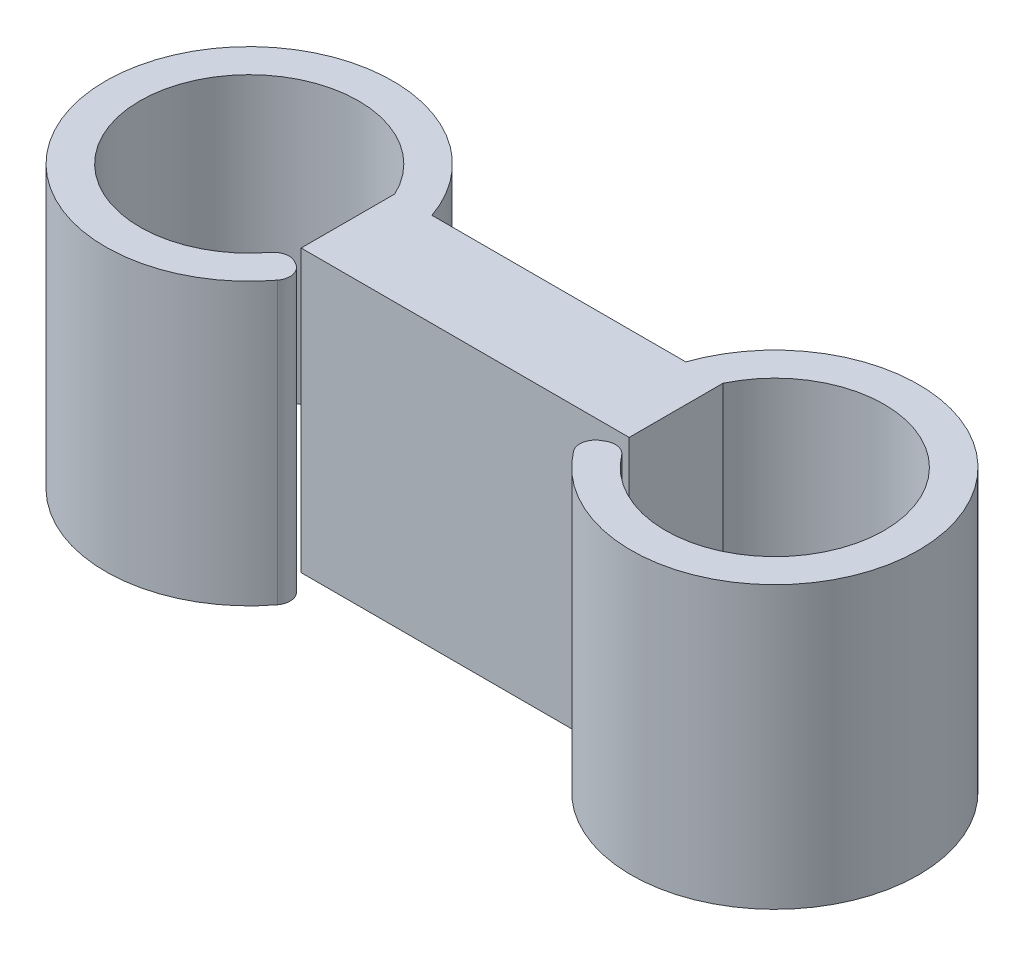
ISO-10303-21;
HEADER;
FILE_DESCRIPTION(('STEP AP214'),'2;1');
FILE_NAME('part.step','',(''),(''),'','','');
FILE_SCHEMA(('AUTOMOTIVE_DESIGN { 1 0 10303 214 1 1 1 1 }'));
ENDSEC;
DATA;
#1=APPLICATION_CONTEXT('core data for automotive mechanical design processes');
#2=APPLICATION_PROTOCOL_DEFINITION('international standard','automotive_design',2000,#1);
#3=PRODUCT_CONTEXT('',#1,'mechanical');
#4=PRODUCT('Part','Part','',(#3));
#5=PRODUCT_RELATED_PRODUCT_CATEGORY('part','',(#4));
#6=PRODUCT_DEFINITION_FORMATION('','',#4);
#7=PRODUCT_DEFINITION_CONTEXT('part definition',#1,'design');
#8=PRODUCT_DEFINITION('design','',#6,#7);
#9=PRODUCT_DEFINITION_SHAPE('','',#8);
#10=(LENGTH_UNIT() NAMED_UNIT(*) SI_UNIT(.MILLI.,.METRE.));
#11=(NAMED_UNIT(*) PLANE_ANGLE_UNIT() SI_UNIT($,.RADIAN.));
#12=(NAMED_UNIT(*) SI_UNIT($,.STERADIAN.) SOLID_ANGLE_UNIT());
#13=UNCERTAINTY_MEASURE_WITH_UNIT(LENGTH_MEASURE(1.E-05),#10,'distance_accuracy_value','');
#14=(GEOMETRIC_REPRESENTATION_CONTEXT(3) GLOBAL_UNCERTAINTY_ASSIGNED_CONTEXT((#13)) GLOBAL_UNIT_ASSIGNED_CONTEXT((#10,
#11,#12)) REPRESENTATION_CONTEXT('',''));
#15=CARTESIAN_POINT('',(0.,0.,0.));
#16=DIRECTION('',(0.,0.,1.));
#17=DIRECTION('',(1.,0.,0.));
#18=AXIS2_PLACEMENT_3D('',#15,#16,#17);
#19=CARTESIAN_POINT('',(-10.5,18.,-3.));
#20=DIRECTION('',(1.,0.,0.));
#21=DIRECTION('',(0.,0.,-1.));
#22=AXIS2_PLACEMENT_3D('',#19,#20,#21);
#23=PLANE('',#22);
#24=DIRECTION('',(0.,0.,1.));
#25=VECTOR('',#24,1.);
#26=CARTESIAN_POINT('',(-10.5,0.,-3.));
#27=LINE('',#26,#25);
#28=CARTESIAN_POINT('',(-10.5,0.,-3.));
#29=VERTEX_POINT('',#28);
#30=CARTESIAN_POINT('',(-10.5,0.,3.));
#31=VERTEX_POINT('',#30);
#32=EDGE_CURVE('E189',#29,#31,#27,.T.);
#33=ORIENTED_EDGE('',*,*,#32,.T.);
#34=DIRECTION('',(0.,-1.,0.));
#35=VECTOR('',#34,1.);
#36=CARTESIAN_POINT('',(-10.5,18.,3.));
#37=LINE('',#36,#35);
#38=CARTESIAN_POINT('',(-10.5,18.,3.));
#39=VERTEX_POINT('',#38);
#40=EDGE_CURVE('E235',#39,#31,#37,.T.);
#41=ORIENTED_EDGE('',*,*,#40,.F.);
#42=DIRECTION('',(0.,0.,1.));
#43=VECTOR('',#42,1.);
#44=CARTESIAN_POINT('',(-10.5,18.,-3.));
#45=LINE('',#44,#43);
#46=CARTESIAN_POINT('',(-10.5,18.,-3.));
#47=VERTEX_POINT('',#46);
#48=EDGE_CURVE('E155',#47,#39,#45,.T.);
#49=ORIENTED_EDGE('',*,*,#48,.F.);
#50=DIRECTION('',(0.,-1.,0.));
#51=VECTOR('',#50,1.);
#52=CARTESIAN_POINT('',(-10.5,18.,-3.));
#53=LINE('',#52,#51);
#54=EDGE_CURVE('E214',#47,#29,#53,.T.);
#55=ORIENTED_EDGE('',*,*,#54,.T.);
#56=EDGE_LOOP('',(#33,#41,#49,#55));
#57=FACE_BOUND('',#56,.T.);
#58=ADVANCED_FACE('F42',(#57),#23,.F.);
#59=CARTESIAN_POINT('',(-10.5,18.,3.));
#60=DIRECTION('',(0.,0.,-1.));
#61=DIRECTION('',(-1.,0.,0.));
#62=AXIS2_PLACEMENT_3D('',#59,#60,#61);
#63=PLANE('',#62);
#64=DIRECTION('',(1.,0.,0.));
#65=VECTOR('',#64,1.);
#66=CARTESIAN_POINT('',(-10.5,0.,3.));
#67=LINE('',#66,#65);
#68=CARTESIAN_POINT('',(10.5,0.,3.));
#69=VERTEX_POINT('',#68);
#70=EDGE_CURVE('E218',#31,#69,#67,.T.);
#71=ORIENTED_EDGE('',*,*,#70,.T.);
#72=DIRECTION('',(0.,-1.,0.));
#73=VECTOR('',#72,1.);
#74=CARTESIAN_POINT('',(10.5,18.,3.));
#75=LINE('',#74,#73);
#76=CARTESIAN_POINT('',(10.5,18.,3.));
#77=VERTEX_POINT('',#76);
#78=EDGE_CURVE('E231',#77,#69,#75,.T.);
#79=ORIENTED_EDGE('',*,*,#78,.F.);
#80=DIRECTION('',(1.,0.,0.));
#81=VECTOR('',#80,1.);
#82=CARTESIAN_POINT('',(-10.5,18.,3.));
#83=LINE('',#82,#81);
#84=EDGE_CURVE('E206',#39,#77,#83,.T.);
#85=ORIENTED_EDGE('',*,*,#84,.F.);
#86=ORIENTED_EDGE('',*,*,#40,.T.);
#87=EDGE_LOOP('',(#71,#79,#85,#86));
#88=FACE_BOUND('',#87,.T.);
#89=ADVANCED_FACE('F327',(#88),#63,.F.);
#90=CARTESIAN_POINT('',(10.5,18.,-3.));
#91=DIRECTION('',(-1.,0.,0.));
#92=DIRECTION('',(0.,0.,1.));
#93=AXIS2_PLACEMENT_3D('',#90,#91,#92);
#94=PLANE('',#93);
#95=DIRECTION('',(0.,0.,-1.));
#96=VECTOR('',#95,1.);
#97=CARTESIAN_POINT('',(10.5,0.,-3.));
#98=LINE('',#97,#96);
#99=CARTESIAN_POINT('',(10.5,0.,-3.));
#100=VERTEX_POINT('',#99);
#101=EDGE_CURVE('E156',#69,#100,#98,.T.);
#102=ORIENTED_EDGE('',*,*,#101,.T.);
#103=DIRECTION('',(0.,-1.,0.));
#104=VECTOR('',#103,1.);
#105=CARTESIAN_POINT('',(10.5,18.,-3.));
#106=LINE('',#105,#104);
#107=CARTESIAN_POINT('',(10.5,18.,-3.));
#108=VERTEX_POINT('',#107);
#109=EDGE_CURVE('E227',#108,#100,#106,.T.);
#110=ORIENTED_EDGE('',*,*,#109,.F.);
#111=DIRECTION('',(0.,0.,-1.));
#112=VECTOR('',#111,1.);
#113=CARTESIAN_POINT('',(10.5,18.,-3.));
#114=LINE('',#113,#112);
#115=EDGE_CURVE('E209',#77,#108,#114,.T.);
#116=ORIENTED_EDGE('',*,*,#115,.F.);
#117=ORIENTED_EDGE('',*,*,#78,.T.);
#118=EDGE_LOOP('',(#102,#110,#116,#117));
#119=FACE_BOUND('',#118,.T.);
#120=ADVANCED_FACE('F323',(#119),#94,.F.);
#121=CARTESIAN_POINT('',(-10.5,18.,-3.));
#122=DIRECTION('',(0.,0.,1.));
#123=DIRECTION('',(1.,0.,0.));
#124=AXIS2_PLACEMENT_3D('',#121,#122,#123);
#125=PLANE('',#124);
#126=DIRECTION('',(-1.,0.,0.));
#127=VECTOR('',#126,1.);
#128=CARTESIAN_POINT('',(-10.5,18.,-3.));
#129=LINE('',#128,#127);
#130=CARTESIAN_POINT('',(8.1274293582732,18.,-3.));
#131=VERTEX_POINT('',#130);
#132=CARTESIAN_POINT('',(-8.12742935827321,18.,-3.));
#133=VERTEX_POINT('',#132);
#134=EDGE_CURVE('E162',#131,#133,#129,.T.);
#135=ORIENTED_EDGE('',*,*,#134,.F.);
#136=DIRECTION('',(0.,1.,0.));
#137=VECTOR('',#136,1.);
#138=CARTESIAN_POINT('',(8.1274293582732,-25.6684069957987,-3.00000000000001));
#139=LINE('',#138,#137);
#140=CARTESIAN_POINT('',(8.1274293582732,0.,-3.00000000000001));
#141=VERTEX_POINT('',#140);
#142=EDGE_CURVE('E160',#141,#131,#139,.T.);
#143=ORIENTED_EDGE('',*,*,#142,.F.);
#144=DIRECTION('',(-1.,0.,0.));
#145=VECTOR('',#144,1.);
#146=CARTESIAN_POINT('',(-10.5,0.,-3.));
#147=LINE('',#146,#145);
#148=CARTESIAN_POINT('',(-8.12742935827321,0.,-3.));
#149=VERTEX_POINT('',#148);
#150=EDGE_CURVE('E144',#141,#149,#147,.T.);
#151=ORIENTED_EDGE('',*,*,#150,.T.);
#152=DIRECTION('',(0.,1.,0.));
#153=VECTOR('',#152,1.);
#154=CARTESIAN_POINT('',(-8.12742935827321,-25.6684069957987,-3.));
#155=LINE('',#154,#153);
#156=EDGE_CURVE('E182',#149,#133,#155,.T.);
#157=ORIENTED_EDGE('',*,*,#156,.T.);
#158=EDGE_LOOP('',(#135,#143,#151,#157));
#159=FACE_BOUND('',#158,.T.);
#160=ADVANCED_FACE('F161',(#159),#125,.F.);
#161=CARTESIAN_POINT('',(0.,18.,0.));
#162=DIRECTION('',(0.,1.,0.));
#163=DIRECTION('',(0.,0.,1.));
#164=AXIS2_PLACEMENT_3D('',#161,#162,#163);
#165=PLANE('',#164);
#166=CARTESIAN_POINT('',(16.8245553203368,18.,0.));
#167=DIRECTION('',(0.,-1.,0.));
#168=DIRECTION('',(0.,0.,-1.));
#169=AXIS2_PLACEMENT_3D('',#166,#167,#168);
#170=CIRCLE('',#169,7.);
#171=CARTESIAN_POINT('',(11.2474247207072,18.,4.23032082408365));
#172=VERTEX_POINT('',#171);
#173=EDGE_CURVE('E301',#108,#172,#170,.T.);
#174=ORIENTED_EDGE('',*,*,#173,.T.);
#175=CARTESIAN_POINT('',(10.450691777903,18.,4.83465237038132));
#176=DIRECTION('',(0.,1.,0.));
#177=DIRECTION('',(0.,0.,1.));
#178=AXIS2_PLACEMENT_3D('',#175,#176,#177);
#179=CIRCLE('',#178,1.);
#180=CARTESIAN_POINT('',(9.95069177790301,18.,3.96862696659688));
#181=VERTEX_POINT('',#180);
#182=EDGE_CURVE('E252',#172,#181,#179,.T.);
#183=ORIENTED_EDGE('',*,*,#182,.T.);
#184=DIRECTION('',(-0.866025403784437,0.,0.500000000000003));
#185=VECTOR('',#184,1.);
#186=CARTESIAN_POINT('',(10.7623774938457,18.,3.49999999999999));
#187=LINE('',#186,#185);
#188=CARTESIAN_POINT('',(9.77615124565434,18.,4.06939798987516));
#189=VERTEX_POINT('',#188);
#190=EDGE_CURVE('E164',#181,#189,#187,.T.);
#191=ORIENTED_EDGE('',*,*,#190,.T.);
#192=CARTESIAN_POINT('',(10.2761512456543,18.,4.93542339365959));
#193=DIRECTION('',(0.,1.,0.));
#194=DIRECTION('',(0.,0.,1.));
#195=AXIS2_PLACEMENT_3D('',#192,#193,#194);
#196=CIRCLE('',#195,1.);
#197=CARTESIAN_POINT('',(9.47756538288819,18.,5.5373042953254));
#198=VERTEX_POINT('',#197);
#199=EDGE_CURVE('E249',#189,#198,#196,.T.);
#200=ORIENTED_EDGE('',*,*,#199,.T.);
#201=CARTESIAN_POINT('',(16.8245553203368,18.,0.));
#202=DIRECTION('',(0.,1.,0.));
#203=DIRECTION('',(0.,0.,-1.));
#204=AXIS2_PLACEMENT_3D('',#201,#202,#203);
#205=CIRCLE('',#204,9.2);
#206=EDGE_CURVE('E174',#198,#131,#205,.T.);
#207=ORIENTED_EDGE('',*,*,#206,.T.);
#208=ORIENTED_EDGE('',*,*,#134,.T.);
#209=CARTESIAN_POINT('',(-16.8245553203368,18.,0.));
#210=DIRECTION('',(0.,1.,0.));
#211=DIRECTION('',(0.,0.,1.));
#212=AXIS2_PLACEMENT_3D('',#209,#210,#211);
#213=CIRCLE('',#212,9.2);
#214=CARTESIAN_POINT('',(-9.47756538288819,18.,5.53730429532541));
#215=VERTEX_POINT('',#214);
#216=EDGE_CURVE('E193',#133,#215,#213,.T.);
#217=ORIENTED_EDGE('',*,*,#216,.T.);
#218=CARTESIAN_POINT('',(-10.2761512456543,18.,4.9354233936596));
#219=DIRECTION('',(0.,1.,0.));
#220=DIRECTION('',(0.,0.,1.));
#221=AXIS2_PLACEMENT_3D('',#218,#219,#220);
#222=CIRCLE('',#221,1.);
#223=CARTESIAN_POINT('',(-9.77615124565434,18.,4.06939798987517));
#224=VERTEX_POINT('',#223);
#225=EDGE_CURVE('E246',#215,#224,#222,.T.);
#226=ORIENTED_EDGE('',*,*,#225,.T.);
#227=DIRECTION('',(-0.866025403784438,0.,-0.500000000000001));
#228=VECTOR('',#227,1.);
#229=CARTESIAN_POINT('',(-10.7623774938457,18.,3.50000000000001));
#230=LINE('',#229,#228);
#231=CARTESIAN_POINT('',(-9.95069177790301,18.,3.96862696659689));
#232=VERTEX_POINT('',#231);
#233=EDGE_CURVE('E197',#224,#232,#230,.T.);
#234=ORIENTED_EDGE('',*,*,#233,.T.);
#235=CARTESIAN_POINT('',(-10.450691777903,18.,4.83465237038133));
#236=DIRECTION('',(0.,1.,0.));
#237=DIRECTION('',(0.,0.,1.));
#238=AXIS2_PLACEMENT_3D('',#235,#236,#237);
#239=CIRCLE('',#238,1.);
#240=CARTESIAN_POINT('',(-11.2474247207072,18.,4.23032082408366));
#241=VERTEX_POINT('',#240);
#242=EDGE_CURVE('E243',#232,#241,#239,.T.);
#243=ORIENTED_EDGE('',*,*,#242,.T.);
#244=CARTESIAN_POINT('',(-16.8245553203368,18.,0.));
#245=DIRECTION('',(0.,-1.,0.));
#246=DIRECTION('',(0.,0.,1.));
#247=AXIS2_PLACEMENT_3D('',#244,#245,#246);
#248=CIRCLE('',#247,7.);
#249=EDGE_CURVE('E190',#241,#47,#248,.T.);
#250=ORIENTED_EDGE('',*,*,#249,.T.);
#251=ORIENTED_EDGE('',*,*,#48,.T.);
#252=ORIENTED_EDGE('',*,*,#84,.T.);
#253=ORIENTED_EDGE('',*,*,#115,.T.);
#254=EDGE_LOOP('',(#174,#183,#191,#200,#207,#208,#217,#226,#234,#243,#250,#251,#252,#253));
#255=FACE_BOUND('',#254,.T.);
#256=ADVANCED_FACE('F298',(#255),#165,.T.);
#257=CARTESIAN_POINT('',(0.,0.,0.));
#258=DIRECTION('',(0.,1.,0.));
#259=DIRECTION('',(0.,0.,1.));
#260=AXIS2_PLACEMENT_3D('',#257,#258,#259);
#261=PLANE('',#260);
#262=DIRECTION('',(0.866025403784437,0.,-0.500000000000003));
#263=VECTOR('',#262,1.);
#264=CARTESIAN_POINT('',(10.7623774938457,0.,3.49999999999999));
#265=LINE('',#264,#263);
#266=CARTESIAN_POINT('',(9.77615124565434,0.,4.06939798987516));
#267=VERTEX_POINT('',#266);
#268=CARTESIAN_POINT('',(9.95069177790301,0.,3.96862696659688));
#269=VERTEX_POINT('',#268);
#270=EDGE_CURVE('E169',#267,#269,#265,.T.);
#271=ORIENTED_EDGE('',*,*,#270,.T.);
#272=CARTESIAN_POINT('',(10.450691777903,0.,4.83465237038132));
#273=DIRECTION('',(0.,1.,0.));
#274=DIRECTION('',(0.,0.,1.));
#275=AXIS2_PLACEMENT_3D('',#272,#273,#274);
#276=CIRCLE('',#275,1.);
#277=CARTESIAN_POINT('',(11.2474247207072,0.,4.23032082408365));
#278=VERTEX_POINT('',#277);
#279=EDGE_CURVE('E270',#269,#278,#276,.F.);
#280=ORIENTED_EDGE('',*,*,#279,.T.);
#281=CARTESIAN_POINT('',(16.8245553203368,0.,0.));
#282=DIRECTION('',(0.,1.,0.));
#283=DIRECTION('',(0.,0.,1.));
#284=AXIS2_PLACEMENT_3D('',#281,#282,#283);
#285=CIRCLE('',#284,7.);
#286=EDGE_CURVE('E165',#278,#100,#285,.T.);
#287=ORIENTED_EDGE('',*,*,#286,.T.);
#288=ORIENTED_EDGE('',*,*,#101,.F.);
#289=ORIENTED_EDGE('',*,*,#70,.F.);
#290=ORIENTED_EDGE('',*,*,#32,.F.);
#291=CARTESIAN_POINT('',(-16.8245553203368,0.,0.));
#292=DIRECTION('',(0.,1.,0.));
#293=DIRECTION('',(0.,0.,1.));
#294=AXIS2_PLACEMENT_3D('',#291,#292,#293);
#295=CIRCLE('',#294,7.);
#296=CARTESIAN_POINT('',(-11.2474247207072,0.,4.23032082408366));
#297=VERTEX_POINT('',#296);
#298=EDGE_CURVE('E185',#29,#297,#295,.T.);
#299=ORIENTED_EDGE('',*,*,#298,.T.);
#300=CARTESIAN_POINT('',(-10.450691777903,0.,4.83465237038133));
#301=DIRECTION('',(0.,1.,0.));
#302=DIRECTION('',(0.,0.,1.));
#303=AXIS2_PLACEMENT_3D('',#300,#301,#302);
#304=CIRCLE('',#303,1.);
#305=CARTESIAN_POINT('',(-9.95069177790301,0.,3.96862696659689));
#306=VERTEX_POINT('',#305);
#307=EDGE_CURVE('E262',#297,#306,#304,.F.);
#308=ORIENTED_EDGE('',*,*,#307,.T.);
#309=DIRECTION('',(0.866025403784438,0.,0.500000000000001));
#310=VECTOR('',#309,1.);
#311=CARTESIAN_POINT('',(-10.7623774938457,0.,3.50000000000001));
#312=LINE('',#311,#310);
#313=CARTESIAN_POINT('',(-9.77615124565434,0.,4.06939798987517));
#314=VERTEX_POINT('',#313);
#315=EDGE_CURVE('E181',#306,#314,#312,.T.);
#316=ORIENTED_EDGE('',*,*,#315,.T.);
#317=CARTESIAN_POINT('',(-10.2761512456543,0.,4.9354233936596));
#318=DIRECTION('',(0.,1.,0.));
#319=DIRECTION('',(0.,0.,1.));
#320=AXIS2_PLACEMENT_3D('',#317,#318,#319);
#321=CIRCLE('',#320,1.);
#322=CARTESIAN_POINT('',(-9.47756538288819,0.,5.53730429532541));
#323=VERTEX_POINT('',#322);
#324=EDGE_CURVE('E66',#314,#323,#321,.F.);
#325=ORIENTED_EDGE('',*,*,#324,.T.);
#326=CARTESIAN_POINT('',(-16.8245553203368,0.,0.));
#327=DIRECTION('',(0.,1.,0.));
#328=DIRECTION('',(0.,0.,1.));
#329=AXIS2_PLACEMENT_3D('',#326,#327,#328);
#330=CIRCLE('',#329,9.2);
#331=EDGE_CURVE('E150',#323,#149,#330,.F.);
#332=ORIENTED_EDGE('',*,*,#331,.T.);
#333=ORIENTED_EDGE('',*,*,#150,.F.);
#334=CARTESIAN_POINT('',(16.8245553203368,0.,0.));
#335=DIRECTION('',(0.,1.,0.));
#336=DIRECTION('',(0.,0.,1.));
#337=AXIS2_PLACEMENT_3D('',#334,#335,#336);
#338=CIRCLE('',#337,9.2);
#339=CARTESIAN_POINT('',(9.47756538288819,0.,5.5373042953254));
#340=VERTEX_POINT('',#339);
#341=EDGE_CURVE('E148',#141,#340,#338,.F.);
#342=ORIENTED_EDGE('',*,*,#341,.T.);
#343=CARTESIAN_POINT('',(10.2761512456543,0.,4.93542339365959));
#344=DIRECTION('',(0.,1.,0.));
#345=DIRECTION('',(0.,0.,1.));
#346=AXIS2_PLACEMENT_3D('',#343,#344,#345);
#347=CIRCLE('',#346,1.);
#348=EDGE_CURVE('E267',#340,#267,#347,.F.);
#349=ORIENTED_EDGE('',*,*,#348,.T.);
#350=EDGE_LOOP('',(#271,#280,#287,#288,#289,#290,#299,#308,#316,#325,#332,#333,#342,#349));
#351=FACE_BOUND('',#350,.T.);
#352=ADVANCED_FACE('F147',(#351),#261,.F.);
#353=CARTESIAN_POINT('',(-16.8245553203368,-25.6684069957987,0.));
#354=DIRECTION('',(0.,1.,0.));
#355=DIRECTION('',(0.,0.,1.));
#356=AXIS2_PLACEMENT_3D('',#353,#354,#355);
#357=CYLINDRICAL_SURFACE('',#356,7.);
#358=ORIENTED_EDGE('',*,*,#249,.F.);
#359=DIRECTION('',(0.,1.,0.));
#360=VECTOR('',#359,1.);
#361=CARTESIAN_POINT('',(-11.2474247207072,-25.6684069957987,4.23032082408367));
#362=LINE('',#361,#360);
#363=EDGE_CURVE('E11',#241,#297,#362,.F.);
#364=ORIENTED_EDGE('',*,*,#363,.T.);
#365=ORIENTED_EDGE('',*,*,#298,.F.);
#366=ORIENTED_EDGE('',*,*,#54,.F.);
#367=EDGE_LOOP('',(#358,#364,#365,#366));
#368=FACE_BOUND('',#367,.T.);
#369=ADVANCED_FACE('F334',(#368),#357,.F.);
#370=CARTESIAN_POINT('',(-10.7623774938457,-25.6684069957987,3.50000000000001));
#371=DIRECTION('',(0.500000000000001,0.,-0.866025403784438));
#372=DIRECTION('',(-0.866025403784438,0.,-0.500000000000001));
#373=AXIS2_PLACEMENT_3D('',#370,#371,#372);
#374=PLANE('',#373);
#375=ORIENTED_EDGE('',*,*,#233,.F.);
#376=DIRECTION('',(0.,1.,0.));
#377=VECTOR('',#376,1.);
#378=CARTESIAN_POINT('',(-9.77615124565434,-25.6684069957987,4.06939798987517));
#379=LINE('',#378,#377);
#380=EDGE_CURVE('E51',#224,#314,#379,.F.);
#381=ORIENTED_EDGE('',*,*,#380,.T.);
#382=ORIENTED_EDGE('',*,*,#315,.F.);
#383=DIRECTION('',(0.,1.,0.));
#384=VECTOR('',#383,1.);
#385=CARTESIAN_POINT('',(-9.95069177790301,-25.6684069957987,3.96862696659689));
#386=LINE('',#385,#384);
#387=EDGE_CURVE('E279',#306,#232,#386,.T.);
#388=ORIENTED_EDGE('',*,*,#387,.T.);
#389=EDGE_LOOP('',(#375,#381,#382,#388));
#390=FACE_BOUND('',#389,.T.);
#391=ADVANCED_FACE('F287',(#390),#374,.T.);
#392=CARTESIAN_POINT('',(-16.8245553203368,-25.6684069957987,0.));
#393=DIRECTION('',(0.,1.,0.));
#394=DIRECTION('',(0.,0.,1.));
#395=AXIS2_PLACEMENT_3D('',#392,#393,#394);
#396=CYLINDRICAL_SURFACE('',#395,9.2);
#397=ORIENTED_EDGE('',*,*,#331,.F.);
#398=DIRECTION('',(0.,1.,0.));
#399=VECTOR('',#398,1.);
#400=CARTESIAN_POINT('',(-9.47756538288819,-25.6684069957987,5.53730429532541));
#401=LINE('',#400,#399);
#402=EDGE_CURVE('E275',#323,#215,#401,.T.);
#403=ORIENTED_EDGE('',*,*,#402,.T.);
#404=ORIENTED_EDGE('',*,*,#216,.F.);
#405=ORIENTED_EDGE('',*,*,#156,.F.);
#406=EDGE_LOOP('',(#397,#403,#404,#405));
#407=FACE_BOUND('',#406,.T.);
#408=ADVANCED_FACE('F295',(#407),#396,.T.);
#409=CARTESIAN_POINT('',(16.8245553203368,-25.6684069957987,0.));
#410=DIRECTION('',(0.,1.,0.));
#411=DIRECTION('',(0.,0.,1.));
#412=AXIS2_PLACEMENT_3D('',#409,#410,#411);
#413=CYLINDRICAL_SURFACE('',#412,9.2);
#414=ORIENTED_EDGE('',*,*,#206,.F.);
#415=DIRECTION('',(0.,1.,0.));
#416=VECTOR('',#415,1.);
#417=CARTESIAN_POINT('',(9.47756538288819,-25.6684069957987,5.5373042953254));
#418=LINE('',#417,#416);
#419=EDGE_CURVE('E58',#198,#340,#418,.F.);
#420=ORIENTED_EDGE('',*,*,#419,.T.);
#421=ORIENTED_EDGE('',*,*,#341,.F.);
#422=ORIENTED_EDGE('',*,*,#142,.T.);
#423=EDGE_LOOP('',(#414,#420,#421,#422));
#424=FACE_BOUND('',#423,.T.);
#425=ADVANCED_FACE('F167',(#424),#413,.T.);
#426=CARTESIAN_POINT('',(10.7623774938457,-25.6684069957987,3.49999999999999));
#427=DIRECTION('',(-0.500000000000003,0.,-0.866025403784437));
#428=DIRECTION('',(-0.866025403784437,0.,0.500000000000003));
#429=AXIS2_PLACEMENT_3D('',#426,#427,#428);
#430=PLANE('',#429);
#431=ORIENTED_EDGE('',*,*,#190,.F.);
#432=DIRECTION('',(0.,1.,0.));
#433=VECTOR('',#432,1.);
#434=CARTESIAN_POINT('',(9.95069177790301,-25.6684069957987,3.96862696659688));
#435=LINE('',#434,#433);
#436=EDGE_CURVE('E259',#181,#269,#435,.F.);
#437=ORIENTED_EDGE('',*,*,#436,.T.);
#438=ORIENTED_EDGE('',*,*,#270,.F.);
#439=DIRECTION('',(0.,1.,0.));
#440=VECTOR('',#439,1.);
#441=CARTESIAN_POINT('',(9.77615124565434,-25.6684069957987,4.06939798987516));
#442=LINE('',#441,#440);
#443=EDGE_CURVE('E255',#267,#189,#442,.T.);
#444=ORIENTED_EDGE('',*,*,#443,.T.);
#445=EDGE_LOOP('',(#431,#437,#438,#444));
#446=FACE_BOUND('',#445,.T.);
#447=ADVANCED_FACE('F309',(#446),#430,.T.);
#448=CARTESIAN_POINT('',(16.8245553203368,-25.6684069957987,0.));
#449=DIRECTION('',(0.,1.,0.));
#450=DIRECTION('',(0.,0.,1.));
#451=AXIS2_PLACEMENT_3D('',#448,#449,#450);
#452=CYLINDRICAL_SURFACE('',#451,7.);
#453=ORIENTED_EDGE('',*,*,#286,.F.);
#454=DIRECTION('',(0.,1.,0.));
#455=VECTOR('',#454,1.);
#456=CARTESIAN_POINT('',(11.2474247207072,-25.6684069957987,4.23032082408365));
#457=LINE('',#456,#455);
#458=EDGE_CURVE('E239',#278,#172,#457,.T.);
#459=ORIENTED_EDGE('',*,*,#458,.T.);
#460=ORIENTED_EDGE('',*,*,#173,.F.);
#461=ORIENTED_EDGE('',*,*,#109,.T.);
#462=EDGE_LOOP('',(#453,#459,#460,#461));
#463=FACE_BOUND('',#462,.T.);
#464=ADVANCED_FACE('F319',(#463),#452,.F.);
#465=CARTESIAN_POINT('',(10.450691777903,-25.6684069957987,4.83465237038132));
#466=DIRECTION('',(0.,1.,0.));
#467=DIRECTION('',(0.,0.,1.));
#468=AXIS2_PLACEMENT_3D('',#465,#466,#467);
#469=CYLINDRICAL_SURFACE('',#468,1.);
#470=ORIENTED_EDGE('',*,*,#279,.F.);
#471=ORIENTED_EDGE('',*,*,#436,.F.);
#472=ORIENTED_EDGE('',*,*,#182,.F.);
#473=ORIENTED_EDGE('',*,*,#458,.F.);
#474=EDGE_LOOP('',(#470,#471,#472,#473));
#475=FACE_BOUND('',#474,.T.);
#476=ADVANCED_FACE('F314',(#475),#469,.T.);
#477=CARTESIAN_POINT('',(10.2761512456543,-25.6684069957987,4.93542339365959));
#478=DIRECTION('',(0.,1.,0.));
#479=DIRECTION('',(0.,0.,1.));
#480=AXIS2_PLACEMENT_3D('',#477,#478,#479);
#481=CYLINDRICAL_SURFACE('',#480,1.);
#482=ORIENTED_EDGE('',*,*,#348,.F.);
#483=ORIENTED_EDGE('',*,*,#419,.F.);
#484=ORIENTED_EDGE('',*,*,#199,.F.);
#485=ORIENTED_EDGE('',*,*,#443,.F.);
#486=EDGE_LOOP('',(#482,#483,#484,#485));
#487=FACE_BOUND('',#486,.T.);
#488=ADVANCED_FACE('F341',(#487),#481,.T.);
#489=CARTESIAN_POINT('',(-10.2761512456543,-25.6684069957987,4.9354233936596));
#490=DIRECTION('',(0.,1.,0.));
#491=DIRECTION('',(0.,0.,1.));
#492=AXIS2_PLACEMENT_3D('',#489,#490,#491);
#493=CYLINDRICAL_SURFACE('',#492,1.);
#494=ORIENTED_EDGE('',*,*,#324,.F.);
#495=ORIENTED_EDGE('',*,*,#380,.F.);
#496=ORIENTED_EDGE('',*,*,#225,.F.);
#497=ORIENTED_EDGE('',*,*,#402,.F.);
#498=EDGE_LOOP('',(#494,#495,#496,#497));
#499=FACE_BOUND('',#498,.T.);
#500=ADVANCED_FACE('F292',(#499),#493,.T.);
#501=CARTESIAN_POINT('',(-10.450691777903,-25.6684069957987,4.83465237038133));
#502=DIRECTION('',(0.,1.,0.));
#503=DIRECTION('',(0.,0.,1.));
#504=AXIS2_PLACEMENT_3D('',#501,#502,#503);
#505=CYLINDRICAL_SURFACE('',#504,1.);
#506=ORIENTED_EDGE('',*,*,#307,.F.);
#507=ORIENTED_EDGE('',*,*,#363,.F.);
#508=ORIENTED_EDGE('',*,*,#242,.F.);
#509=ORIENTED_EDGE('',*,*,#387,.F.);
#510=EDGE_LOOP('',(#506,#507,#508,#509));
#511=FACE_BOUND('',#510,.T.);
#512=ADVANCED_FACE('F44',(#511),#505,.T.);
#513=CLOSED_SHELL('',(#58,#89,#120,#160,#256,#352,#369,#391,#408,#425,#447,#464,#476,#488,#500,#512));
#514=MANIFOLD_SOLID_BREP('B2',#513);
#515=ADVANCED_BREP_SHAPE_REPRESENTATION('',(#18,#514),#14);
#516=SHAPE_DEFINITION_REPRESENTATION(#9,#515);
ENDSEC;
END-ISO-10303-21;
